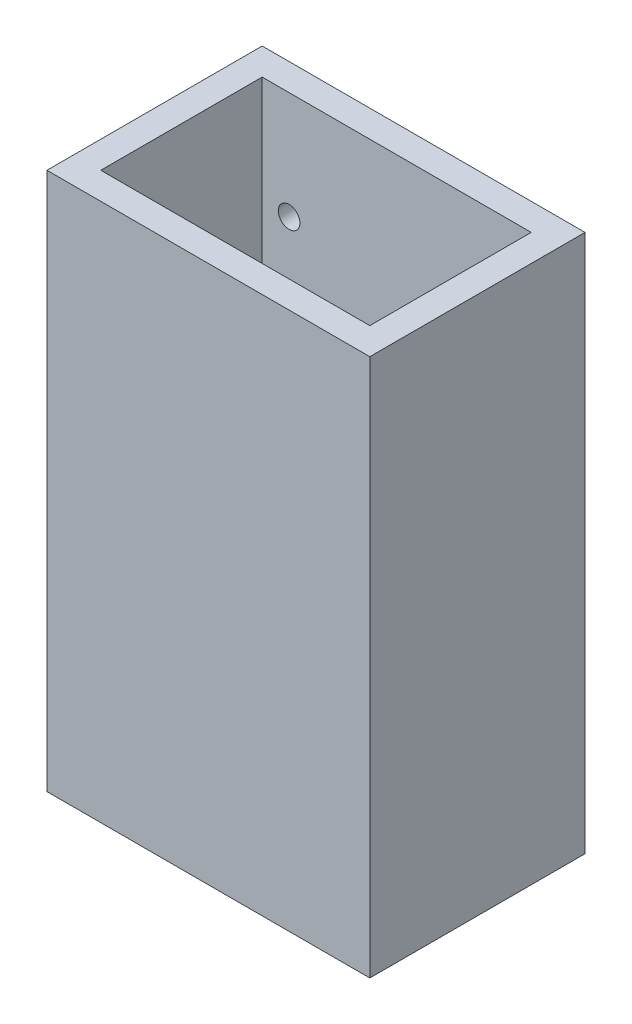
ISO-10303-21;
HEADER;
FILE_DESCRIPTION(('STEP AP214'),'2;1');
FILE_NAME('part.step','',(''),(''),'','','');
FILE_SCHEMA(('AUTOMOTIVE_DESIGN { 1 0 10303 214 1 1 1 1 }'));
ENDSEC;
DATA;
#1=APPLICATION_CONTEXT('core data for automotive mechanical design processes');
#2=APPLICATION_PROTOCOL_DEFINITION('international standard','automotive_design',2000,#1);
#3=PRODUCT_CONTEXT('',#1,'mechanical');
#4=PRODUCT('Part','Part','',(#3));
#5=PRODUCT_RELATED_PRODUCT_CATEGORY('part','',(#4));
#6=PRODUCT_DEFINITION_FORMATION('','',#4);
#7=PRODUCT_DEFINITION_CONTEXT('part definition',#1,'design');
#8=PRODUCT_DEFINITION('design','',#6,#7);
#9=PRODUCT_DEFINITION_SHAPE('','',#8);
#10=(LENGTH_UNIT() NAMED_UNIT(*) SI_UNIT(.MILLI.,.METRE.));
#11=(NAMED_UNIT(*) PLANE_ANGLE_UNIT() SI_UNIT($,.RADIAN.));
#12=(NAMED_UNIT(*) SI_UNIT($,.STERADIAN.) SOLID_ANGLE_UNIT());
#13=UNCERTAINTY_MEASURE_WITH_UNIT(LENGTH_MEASURE(1.E-05),#10,'distance_accuracy_value','');
#14=(GEOMETRIC_REPRESENTATION_CONTEXT(3) GLOBAL_UNCERTAINTY_ASSIGNED_CONTEXT((#13)) GLOBAL_UNIT_ASSIGNED_CONTEXT((#10,
#11,#12)) REPRESENTATION_CONTEXT('',''));
#15=CARTESIAN_POINT('',(0.,0.,0.));
#16=DIRECTION('',(0.,0.,1.));
#17=DIRECTION('',(1.,0.,0.));
#18=AXIS2_PLACEMENT_3D('',#15,#16,#17);
#19=CARTESIAN_POINT('',(0.,127.,0.));
#20=DIRECTION('',(0.,-1.,0.));
#21=DIRECTION('',(0.,0.,-1.));
#22=AXIS2_PLACEMENT_3D('',#19,#20,#21);
#23=PLANE('',#22);
#24=DIRECTION('',(0.,0.,-1.));
#25=VECTOR('',#24,1.);
#26=CARTESIAN_POINT('',(38.1,127.,25.4));
#27=LINE('',#26,#25);
#28=CARTESIAN_POINT('',(38.1,127.,25.4));
#29=VERTEX_POINT('',#28);
#30=CARTESIAN_POINT('',(38.1,127.,-25.4));
#31=VERTEX_POINT('',#30);
#32=EDGE_CURVE('E137',#29,#31,#27,.T.);
#33=ORIENTED_EDGE('',*,*,#32,.T.);
#34=DIRECTION('',(-1.,0.,0.));
#35=VECTOR('',#34,1.);
#36=CARTESIAN_POINT('',(-38.1,127.,-25.4));
#37=LINE('',#36,#35);
#38=CARTESIAN_POINT('',(-38.1,127.,-25.4));
#39=VERTEX_POINT('',#38);
#40=EDGE_CURVE('E140',#31,#39,#37,.T.);
#41=ORIENTED_EDGE('',*,*,#40,.T.);
#42=DIRECTION('',(0.,0.,1.));
#43=VECTOR('',#42,1.);
#44=CARTESIAN_POINT('',(-38.1,127.,25.4));
#45=LINE('',#44,#43);
#46=CARTESIAN_POINT('',(-38.1,127.,25.4));
#47=VERTEX_POINT('',#46);
#48=EDGE_CURVE('E143',#39,#47,#45,.T.);
#49=ORIENTED_EDGE('',*,*,#48,.T.);
#50=DIRECTION('',(1.,0.,0.));
#51=VECTOR('',#50,1.);
#52=CARTESIAN_POINT('',(-38.1,127.,25.4));
#53=LINE('',#52,#51);
#54=EDGE_CURVE('E145',#47,#29,#53,.T.);
#55=ORIENTED_EDGE('',*,*,#54,.T.);
#56=EDGE_LOOP('',(#33,#41,#49,#55));
#57=FACE_BOUND('',#56,.T.);
#58=DIRECTION('',(0.,0.,1.));
#59=VECTOR('',#58,1.);
#60=CARTESIAN_POINT('',(-31.75,127.,19.05));
#61=LINE('',#60,#59);
#62=CARTESIAN_POINT('',(-31.75,127.,-19.05));
#63=VERTEX_POINT('',#62);
#64=CARTESIAN_POINT('',(-31.75,127.,19.05));
#65=VERTEX_POINT('',#64);
#66=EDGE_CURVE('E99',#63,#65,#61,.T.);
#67=ORIENTED_EDGE('',*,*,#66,.F.);
#68=DIRECTION('',(-1.,0.,0.));
#69=VECTOR('',#68,1.);
#70=CARTESIAN_POINT('',(-31.75,127.,-19.05));
#71=LINE('',#70,#69);
#72=CARTESIAN_POINT('',(31.75,127.,-19.05));
#73=VERTEX_POINT('',#72);
#74=EDGE_CURVE('E121',#73,#63,#71,.T.);
#75=ORIENTED_EDGE('',*,*,#74,.F.);
#76=DIRECTION('',(0.,0.,-1.));
#77=VECTOR('',#76,1.);
#78=CARTESIAN_POINT('',(31.75,127.,19.05));
#79=LINE('',#78,#77);
#80=CARTESIAN_POINT('',(31.75,127.,19.05));
#81=VERTEX_POINT('',#80);
#82=EDGE_CURVE('E119',#81,#73,#79,.T.);
#83=ORIENTED_EDGE('',*,*,#82,.F.);
#84=DIRECTION('',(1.,0.,0.));
#85=VECTOR('',#84,1.);
#86=CARTESIAN_POINT('',(-31.75,127.,19.05));
#87=LINE('',#86,#85);
#88=EDGE_CURVE('E107',#65,#81,#87,.T.);
#89=ORIENTED_EDGE('',*,*,#88,.F.);
#90=EDGE_LOOP('',(#67,#75,#83,#89));
#91=FACE_BOUND('',#90,.T.);
#92=ADVANCED_FACE('F34',(#57,#91),#23,.F.);
#93=CARTESIAN_POINT('',(0.,0.,0.));
#94=DIRECTION('',(0.,-1.,0.));
#95=DIRECTION('',(0.,0.,-1.));
#96=AXIS2_PLACEMENT_3D('',#93,#94,#95);
#97=PLANE('',#96);
#98=DIRECTION('',(0.,0.,-1.));
#99=VECTOR('',#98,1.);
#100=CARTESIAN_POINT('',(38.1,0.,25.4));
#101=LINE('',#100,#99);
#102=CARTESIAN_POINT('',(38.1,0.,25.4));
#103=VERTEX_POINT('',#102);
#104=CARTESIAN_POINT('',(38.1,0.,-25.4));
#105=VERTEX_POINT('',#104);
#106=EDGE_CURVE('E115',#103,#105,#101,.T.);
#107=ORIENTED_EDGE('',*,*,#106,.F.);
#108=DIRECTION('',(1.,0.,0.));
#109=VECTOR('',#108,1.);
#110=CARTESIAN_POINT('',(-38.1,0.,25.4));
#111=LINE('',#110,#109);
#112=CARTESIAN_POINT('',(-38.1,0.,25.4));
#113=VERTEX_POINT('',#112);
#114=EDGE_CURVE('E141',#113,#103,#111,.T.);
#115=ORIENTED_EDGE('',*,*,#114,.F.);
#116=DIRECTION('',(0.,0.,1.));
#117=VECTOR('',#116,1.);
#118=CARTESIAN_POINT('',(-38.1,0.,25.4));
#119=LINE('',#118,#117);
#120=CARTESIAN_POINT('',(-38.1,0.,-25.4));
#121=VERTEX_POINT('',#120);
#122=EDGE_CURVE('E152',#121,#113,#119,.T.);
#123=ORIENTED_EDGE('',*,*,#122,.F.);
#124=DIRECTION('',(-1.,0.,0.));
#125=VECTOR('',#124,1.);
#126=CARTESIAN_POINT('',(-38.1,0.,-25.4));
#127=LINE('',#126,#125);
#128=EDGE_CURVE('E150',#105,#121,#127,.T.);
#129=ORIENTED_EDGE('',*,*,#128,.F.);
#130=EDGE_LOOP('',(#107,#115,#123,#129));
#131=FACE_BOUND('',#130,.T.);
#132=DIRECTION('',(-1.,0.,0.));
#133=VECTOR('',#132,1.);
#134=CARTESIAN_POINT('',(-31.75,0.,-19.05));
#135=LINE('',#134,#133);
#136=CARTESIAN_POINT('',(31.75,0.,-19.05));
#137=VERTEX_POINT('',#136);
#138=CARTESIAN_POINT('',(-31.75,0.,-19.05));
#139=VERTEX_POINT('',#138);
#140=EDGE_CURVE('E108',#137,#139,#135,.T.);
#141=ORIENTED_EDGE('',*,*,#140,.T.);
#142=DIRECTION('',(0.,0.,1.));
#143=VECTOR('',#142,1.);
#144=CARTESIAN_POINT('',(-31.75,0.,19.05));
#145=LINE('',#144,#143);
#146=CARTESIAN_POINT('',(-31.75,0.,19.05));
#147=VERTEX_POINT('',#146);
#148=EDGE_CURVE('E57',#139,#147,#145,.T.);
#149=ORIENTED_EDGE('',*,*,#148,.T.);
#150=DIRECTION('',(1.,0.,0.));
#151=VECTOR('',#150,1.);
#152=CARTESIAN_POINT('',(-31.75,0.,19.05));
#153=LINE('',#152,#151);
#154=CARTESIAN_POINT('',(31.75,0.,19.05));
#155=VERTEX_POINT('',#154);
#156=EDGE_CURVE('E114',#147,#155,#153,.T.);
#157=ORIENTED_EDGE('',*,*,#156,.T.);
#158=DIRECTION('',(0.,0.,-1.));
#159=VECTOR('',#158,1.);
#160=CARTESIAN_POINT('',(31.75,0.,19.05));
#161=LINE('',#160,#159);
#162=EDGE_CURVE('E129',#155,#137,#161,.T.);
#163=ORIENTED_EDGE('',*,*,#162,.T.);
#164=EDGE_LOOP('',(#141,#149,#157,#163));
#165=FACE_BOUND('',#164,.T.);
#166=ADVANCED_FACE('F170',(#131,#165),#97,.T.);
#167=CARTESIAN_POINT('',(38.1,127.,25.4));
#168=DIRECTION('',(-1.,0.,0.));
#169=DIRECTION('',(0.,0.,1.));
#170=AXIS2_PLACEMENT_3D('',#167,#168,#169);
#171=PLANE('',#170);
#172=ORIENTED_EDGE('',*,*,#106,.T.);
#173=DIRECTION('',(0.,-1.,0.));
#174=VECTOR('',#173,1.);
#175=CARTESIAN_POINT('',(38.1,127.,-25.4));
#176=LINE('',#175,#174);
#177=EDGE_CURVE('E11',#31,#105,#176,.T.);
#178=ORIENTED_EDGE('',*,*,#177,.F.);
#179=ORIENTED_EDGE('',*,*,#32,.F.);
#180=DIRECTION('',(0.,-1.,0.));
#181=VECTOR('',#180,1.);
#182=CARTESIAN_POINT('',(38.1,127.,25.4));
#183=LINE('',#182,#181);
#184=EDGE_CURVE('E147',#29,#103,#183,.T.);
#185=ORIENTED_EDGE('',*,*,#184,.T.);
#186=EDGE_LOOP('',(#172,#178,#179,#185));
#187=FACE_BOUND('',#186,.T.);
#188=ADVANCED_FACE('F36',(#187),#171,.F.);
#189=CARTESIAN_POINT('',(-38.1,127.,-25.4));
#190=DIRECTION('',(0.,0.,1.));
#191=DIRECTION('',(1.,0.,0.));
#192=AXIS2_PLACEMENT_3D('',#189,#190,#191);
#193=PLANE('',#192);
#194=CARTESIAN_POINT('',(25.4,101.6,-25.4));
#195=DIRECTION('',(0.,0.,-1.));
#196=DIRECTION('',(-1.,0.,0.));
#197=AXIS2_PLACEMENT_3D('',#194,#195,#196);
#198=CIRCLE('',#197,2.55269999999999);
#199=CARTESIAN_POINT('',(22.8473,101.6,-25.4));
#200=VERTEX_POINT('',#199);
#201=EDGE_CURVE('E236',#200,#200,#198,.T.);
#202=ORIENTED_EDGE('',*,*,#201,.F.);
#203=EDGE_LOOP('',(#202));
#204=FACE_BOUND('',#203,.T.);
#205=CARTESIAN_POINT('',(25.4,25.4,-25.4));
#206=DIRECTION('',(0.,0.,-1.));
#207=DIRECTION('',(-1.,0.,0.));
#208=AXIS2_PLACEMENT_3D('',#205,#206,#207);
#209=CIRCLE('',#208,2.55269999999999);
#210=CARTESIAN_POINT('',(22.8473,25.4,-25.4));
#211=VERTEX_POINT('',#210);
#212=EDGE_CURVE('E240',#211,#211,#209,.T.);
#213=ORIENTED_EDGE('',*,*,#212,.F.);
#214=EDGE_LOOP('',(#213));
#215=FACE_BOUND('',#214,.T.);
#216=CARTESIAN_POINT('',(-25.4,25.4,-25.4));
#217=DIRECTION('',(0.,0.,-1.));
#218=DIRECTION('',(-1.,0.,0.));
#219=AXIS2_PLACEMENT_3D('',#216,#217,#218);
#220=CIRCLE('',#219,2.55269999999999);
#221=CARTESIAN_POINT('',(-27.9527,25.4,-25.4));
#222=VERTEX_POINT('',#221);
#223=EDGE_CURVE('E249',#222,#222,#220,.T.);
#224=ORIENTED_EDGE('',*,*,#223,.F.);
#225=EDGE_LOOP('',(#224));
#226=FACE_BOUND('',#225,.T.);
#227=CARTESIAN_POINT('',(-25.4,101.6,-25.4));
#228=DIRECTION('',(0.,0.,-1.));
#229=DIRECTION('',(-1.,0.,0.));
#230=AXIS2_PLACEMENT_3D('',#227,#228,#229);
#231=CIRCLE('',#230,2.55269999999999);
#232=CARTESIAN_POINT('',(-27.9527,101.6,-25.4));
#233=VERTEX_POINT('',#232);
#234=EDGE_CURVE('E255',#233,#233,#231,.T.);
#235=ORIENTED_EDGE('',*,*,#234,.F.);
#236=EDGE_LOOP('',(#235));
#237=FACE_BOUND('',#236,.T.);
#238=ORIENTED_EDGE('',*,*,#128,.T.);
#239=DIRECTION('',(0.,-1.,0.));
#240=VECTOR('',#239,1.);
#241=CARTESIAN_POINT('',(-38.1,127.,-25.4));
#242=LINE('',#241,#240);
#243=EDGE_CURVE('E42',#39,#121,#242,.T.);
#244=ORIENTED_EDGE('',*,*,#243,.F.);
#245=ORIENTED_EDGE('',*,*,#40,.F.);
#246=ORIENTED_EDGE('',*,*,#177,.T.);
#247=EDGE_LOOP('',(#238,#244,#245,#246));
#248=FACE_BOUND('',#247,.T.);
#249=ADVANCED_FACE('F180',(#204,#215,#226,#237,#248),#193,.F.);
#250=CARTESIAN_POINT('',(-38.1,127.,25.4));
#251=DIRECTION('',(1.,0.,0.));
#252=DIRECTION('',(0.,0.,-1.));
#253=AXIS2_PLACEMENT_3D('',#250,#251,#252);
#254=PLANE('',#253);
#255=ORIENTED_EDGE('',*,*,#122,.T.);
#256=DIRECTION('',(0.,-1.,0.));
#257=VECTOR('',#256,1.);
#258=CARTESIAN_POINT('',(-38.1,127.,25.4));
#259=LINE('',#258,#257);
#260=EDGE_CURVE('E157',#47,#113,#259,.T.);
#261=ORIENTED_EDGE('',*,*,#260,.F.);
#262=ORIENTED_EDGE('',*,*,#48,.F.);
#263=ORIENTED_EDGE('',*,*,#243,.T.);
#264=EDGE_LOOP('',(#255,#261,#262,#263));
#265=FACE_BOUND('',#264,.T.);
#266=ADVANCED_FACE('F164',(#265),#254,.F.);
#267=CARTESIAN_POINT('',(-38.1,127.,25.4));
#268=DIRECTION('',(0.,0.,-1.));
#269=DIRECTION('',(-1.,0.,0.));
#270=AXIS2_PLACEMENT_3D('',#267,#268,#269);
#271=PLANE('',#270);
#272=ORIENTED_EDGE('',*,*,#114,.T.);
#273=ORIENTED_EDGE('',*,*,#184,.F.);
#274=ORIENTED_EDGE('',*,*,#54,.F.);
#275=ORIENTED_EDGE('',*,*,#260,.T.);
#276=EDGE_LOOP('',(#272,#273,#274,#275));
#277=FACE_BOUND('',#276,.T.);
#278=ADVANCED_FACE('F174',(#277),#271,.F.);
#279=CARTESIAN_POINT('',(-31.75,127.,19.05));
#280=DIRECTION('',(1.,0.,0.));
#281=DIRECTION('',(0.,0.,-1.));
#282=AXIS2_PLACEMENT_3D('',#279,#280,#281);
#283=PLANE('',#282);
#284=ORIENTED_EDGE('',*,*,#148,.F.);
#285=DIRECTION('',(0.,-1.,0.));
#286=VECTOR('',#285,1.);
#287=CARTESIAN_POINT('',(-31.75,127.,-19.05));
#288=LINE('',#287,#286);
#289=EDGE_CURVE('E103',#63,#139,#288,.T.);
#290=ORIENTED_EDGE('',*,*,#289,.F.);
#291=ORIENTED_EDGE('',*,*,#66,.T.);
#292=DIRECTION('',(0.,-1.,0.));
#293=VECTOR('',#292,1.);
#294=CARTESIAN_POINT('',(-31.75,127.,19.05));
#295=LINE('',#294,#293);
#296=EDGE_CURVE('E102',#65,#147,#295,.T.);
#297=ORIENTED_EDGE('',*,*,#296,.T.);
#298=EDGE_LOOP('',(#284,#290,#291,#297));
#299=FACE_BOUND('',#298,.T.);
#300=ADVANCED_FACE('F101',(#299),#283,.T.);
#301=CARTESIAN_POINT('',(-31.75,127.,19.05));
#302=DIRECTION('',(0.,0.,-1.));
#303=DIRECTION('',(-1.,0.,0.));
#304=AXIS2_PLACEMENT_3D('',#301,#302,#303);
#305=PLANE('',#304);
#306=ORIENTED_EDGE('',*,*,#156,.F.);
#307=ORIENTED_EDGE('',*,*,#296,.F.);
#308=ORIENTED_EDGE('',*,*,#88,.T.);
#309=DIRECTION('',(0.,-1.,0.));
#310=VECTOR('',#309,1.);
#311=CARTESIAN_POINT('',(31.75,127.,19.05));
#312=LINE('',#311,#310);
#313=EDGE_CURVE('E116',#81,#155,#312,.T.);
#314=ORIENTED_EDGE('',*,*,#313,.T.);
#315=EDGE_LOOP('',(#306,#307,#308,#314));
#316=FACE_BOUND('',#315,.T.);
#317=ADVANCED_FACE('F111',(#316),#305,.T.);
#318=CARTESIAN_POINT('',(31.75,127.,19.05));
#319=DIRECTION('',(-1.,0.,0.));
#320=DIRECTION('',(0.,0.,1.));
#321=AXIS2_PLACEMENT_3D('',#318,#319,#320);
#322=PLANE('',#321);
#323=ORIENTED_EDGE('',*,*,#162,.F.);
#324=ORIENTED_EDGE('',*,*,#313,.F.);
#325=ORIENTED_EDGE('',*,*,#82,.T.);
#326=DIRECTION('',(0.,-1.,0.));
#327=VECTOR('',#326,1.);
#328=CARTESIAN_POINT('',(31.75,127.,-19.05));
#329=LINE('',#328,#327);
#330=EDGE_CURVE('E49',#73,#137,#329,.T.);
#331=ORIENTED_EDGE('',*,*,#330,.T.);
#332=EDGE_LOOP('',(#323,#324,#325,#331));
#333=FACE_BOUND('',#332,.T.);
#334=ADVANCED_FACE('F206',(#333),#322,.T.);
#335=CARTESIAN_POINT('',(-31.75,127.,-19.05));
#336=DIRECTION('',(0.,0.,1.));
#337=DIRECTION('',(1.,0.,0.));
#338=AXIS2_PLACEMENT_3D('',#335,#336,#337);
#339=PLANE('',#338);
#340=CARTESIAN_POINT('',(25.4,101.6,-19.05));
#341=DIRECTION('',(0.,0.,1.));
#342=DIRECTION('',(1.,0.,0.));
#343=AXIS2_PLACEMENT_3D('',#340,#341,#342);
#344=CIRCLE('',#343,2.55269999999999);
#345=CARTESIAN_POINT('',(27.9527,101.6,-19.05));
#346=VERTEX_POINT('',#345);
#347=EDGE_CURVE('E239',#346,#346,#344,.T.);
#348=ORIENTED_EDGE('',*,*,#347,.F.);
#349=EDGE_LOOP('',(#348));
#350=FACE_BOUND('',#349,.T.);
#351=CARTESIAN_POINT('',(25.4,25.4,-19.05));
#352=DIRECTION('',(0.,0.,1.));
#353=DIRECTION('',(1.,0.,0.));
#354=AXIS2_PLACEMENT_3D('',#351,#352,#353);
#355=CIRCLE('',#354,2.55269999999999);
#356=CARTESIAN_POINT('',(27.9527,25.4,-19.05));
#357=VERTEX_POINT('',#356);
#358=EDGE_CURVE('E243',#357,#357,#355,.T.);
#359=ORIENTED_EDGE('',*,*,#358,.F.);
#360=EDGE_LOOP('',(#359));
#361=FACE_BOUND('',#360,.T.);
#362=CARTESIAN_POINT('',(-25.4,25.4,-19.05));
#363=DIRECTION('',(0.,0.,1.));
#364=DIRECTION('',(1.,0.,0.));
#365=AXIS2_PLACEMENT_3D('',#362,#363,#364);
#366=CIRCLE('',#365,2.55269999999999);
#367=CARTESIAN_POINT('',(-22.8473,25.4,-19.05));
#368=VERTEX_POINT('',#367);
#369=EDGE_CURVE('E252',#368,#368,#366,.T.);
#370=ORIENTED_EDGE('',*,*,#369,.F.);
#371=EDGE_LOOP('',(#370));
#372=FACE_BOUND('',#371,.T.);
#373=CARTESIAN_POINT('',(-25.4,101.6,-19.05));
#374=DIRECTION('',(0.,0.,1.));
#375=DIRECTION('',(1.,0.,0.));
#376=AXIS2_PLACEMENT_3D('',#373,#374,#375);
#377=CIRCLE('',#376,2.55269999999999);
#378=CARTESIAN_POINT('',(-22.8473,101.6,-19.05));
#379=VERTEX_POINT('',#378);
#380=EDGE_CURVE('E127',#379,#379,#377,.T.);
#381=ORIENTED_EDGE('',*,*,#380,.F.);
#382=EDGE_LOOP('',(#381));
#383=FACE_BOUND('',#382,.T.);
#384=ORIENTED_EDGE('',*,*,#140,.F.);
#385=ORIENTED_EDGE('',*,*,#330,.F.);
#386=ORIENTED_EDGE('',*,*,#74,.T.);
#387=ORIENTED_EDGE('',*,*,#289,.T.);
#388=EDGE_LOOP('',(#384,#385,#386,#387));
#389=FACE_BOUND('',#388,.T.);
#390=ADVANCED_FACE('F210',(#350,#361,#372,#383,#389),#339,.T.);
#391=CARTESIAN_POINT('',(-25.4,101.6,-25.4));
#392=DIRECTION('',(0.,0.,-1.));
#393=DIRECTION('',(-1.,0.,0.));
#394=AXIS2_PLACEMENT_3D('',#391,#392,#393);
#395=CYLINDRICAL_SURFACE('',#394,2.55269999999999);
#396=ORIENTED_EDGE('',*,*,#234,.T.);
#397=EDGE_LOOP('',(#396));
#398=FACE_BOUND('',#397,.T.);
#399=ORIENTED_EDGE('',*,*,#380,.T.);
#400=EDGE_LOOP('',(#399));
#401=FACE_BOUND('',#400,.T.);
#402=ADVANCED_FACE('F216',(#398,#401),#395,.F.);
#403=CARTESIAN_POINT('',(-25.4,25.4,-25.4));
#404=DIRECTION('',(0.,0.,-1.));
#405=DIRECTION('',(-1.,0.,0.));
#406=AXIS2_PLACEMENT_3D('',#403,#404,#405);
#407=CYLINDRICAL_SURFACE('',#406,2.55269999999999);
#408=ORIENTED_EDGE('',*,*,#223,.T.);
#409=EDGE_LOOP('',(#408));
#410=FACE_BOUND('',#409,.T.);
#411=ORIENTED_EDGE('',*,*,#369,.T.);
#412=EDGE_LOOP('',(#411));
#413=FACE_BOUND('',#412,.T.);
#414=ADVANCED_FACE('F220',(#410,#413),#407,.F.);
#415=CARTESIAN_POINT('',(25.4,25.4,-25.4));
#416=DIRECTION('',(0.,0.,-1.));
#417=DIRECTION('',(-1.,0.,0.));
#418=AXIS2_PLACEMENT_3D('',#415,#416,#417);
#419=CYLINDRICAL_SURFACE('',#418,2.55269999999999);
#420=ORIENTED_EDGE('',*,*,#212,.T.);
#421=EDGE_LOOP('',(#420));
#422=FACE_BOUND('',#421,.T.);
#423=ORIENTED_EDGE('',*,*,#358,.T.);
#424=EDGE_LOOP('',(#423));
#425=FACE_BOUND('',#424,.T.);
#426=ADVANCED_FACE('F224',(#422,#425),#419,.F.);
#427=CARTESIAN_POINT('',(25.4,101.6,-25.4));
#428=DIRECTION('',(0.,0.,-1.));
#429=DIRECTION('',(-1.,0.,0.));
#430=AXIS2_PLACEMENT_3D('',#427,#428,#429);
#431=CYLINDRICAL_SURFACE('',#430,2.55269999999999);
#432=ORIENTED_EDGE('',*,*,#201,.T.);
#433=EDGE_LOOP('',(#432));
#434=FACE_BOUND('',#433,.T.);
#435=ORIENTED_EDGE('',*,*,#347,.T.);
#436=EDGE_LOOP('',(#435));
#437=FACE_BOUND('',#436,.T.);
#438=ADVANCED_FACE('F228',(#434,#437),#431,.F.);
#439=CLOSED_SHELL('',(#92,#166,#188,#249,#266,#278,#300,#317,#334,#390,#402,#414,#426,#438));
#440=MANIFOLD_SOLID_BREP('B2',#439);
#441=ADVANCED_BREP_SHAPE_REPRESENTATION('',(#18,#440),#14);
#442=SHAPE_DEFINITION_REPRESENTATION(#9,#441);
ENDSEC;
END-ISO-10303-21;
